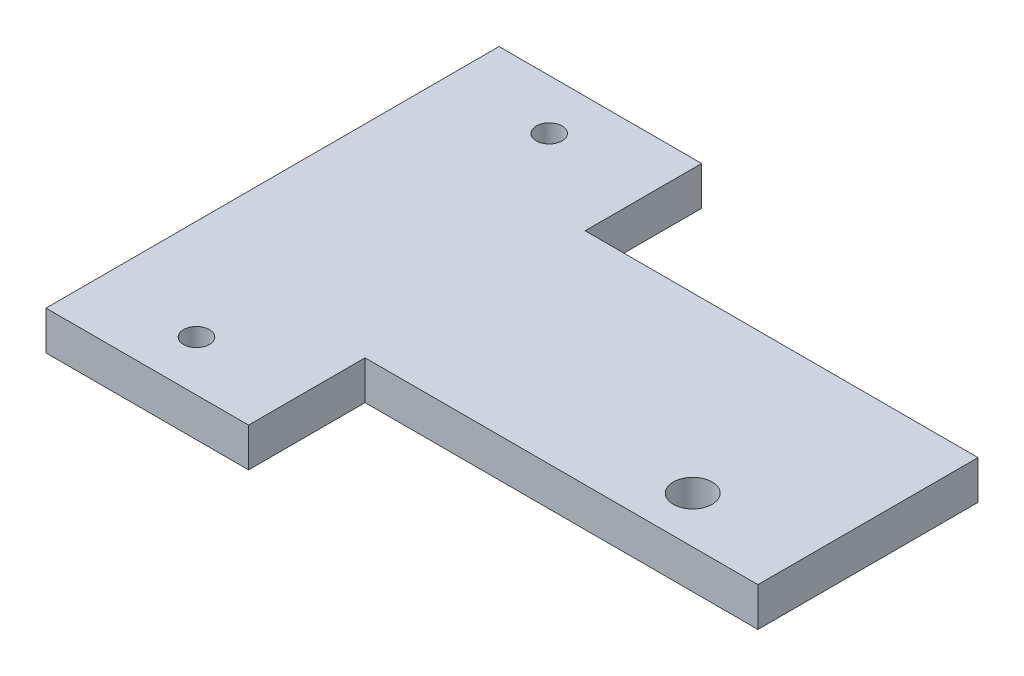
ISO-10303-21;
HEADER;
FILE_DESCRIPTION(('STEP AP214'),'2;1');
FILE_NAME('part.step','',(''),(''),'','','');
FILE_SCHEMA(('AUTOMOTIVE_DESIGN { 1 0 10303 214 1 1 1 1 }'));
ENDSEC;
DATA;
#1=APPLICATION_CONTEXT('core data for automotive mechanical design processes');
#2=APPLICATION_PROTOCOL_DEFINITION('international standard','automotive_design',2000,#1);
#3=PRODUCT_CONTEXT('',#1,'mechanical');
#4=PRODUCT('Part','Part','',(#3));
#5=PRODUCT_RELATED_PRODUCT_CATEGORY('part','',(#4));
#6=PRODUCT_DEFINITION_FORMATION('','',#4);
#7=PRODUCT_DEFINITION_CONTEXT('part definition',#1,'design');
#8=PRODUCT_DEFINITION('design','',#6,#7);
#9=PRODUCT_DEFINITION_SHAPE('','',#8);
#10=(LENGTH_UNIT() NAMED_UNIT(*) SI_UNIT(.MILLI.,.METRE.));
#11=(NAMED_UNIT(*) PLANE_ANGLE_UNIT() SI_UNIT($,.RADIAN.));
#12=(NAMED_UNIT(*) SI_UNIT($,.STERADIAN.) SOLID_ANGLE_UNIT());
#13=UNCERTAINTY_MEASURE_WITH_UNIT(LENGTH_MEASURE(1.E-05),#10,'distance_accuracy_value','');
#14=(GEOMETRIC_REPRESENTATION_CONTEXT(3) GLOBAL_UNCERTAINTY_ASSIGNED_CONTEXT((#13)) GLOBAL_UNIT_ASSIGNED_CONTEXT((#10,
#11,#12)) REPRESENTATION_CONTEXT('',''));
#15=CARTESIAN_POINT('',(0.,0.,0.));
#16=DIRECTION('',(0.,0.,1.));
#17=DIRECTION('',(1.,0.,0.));
#18=AXIS2_PLACEMENT_3D('',#15,#16,#17);
#19=CARTESIAN_POINT('',(23.,3.,-8.5));
#20=DIRECTION('',(0.,0.,1.));
#21=DIRECTION('',(1.,0.,0.));
#22=AXIS2_PLACEMENT_3D('',#19,#20,#21);
#23=PLANE('',#22);
#24=DIRECTION('',(0.,-1.,0.));
#25=VECTOR('',#24,1.);
#26=CARTESIAN_POINT('',(-7.35,0.,-8.5));
#27=LINE('',#26,#25);
#28=CARTESIAN_POINT('',(-7.35,3.,-8.5));
#29=VERTEX_POINT('',#28);
#30=CARTESIAN_POINT('',(-7.35,0.,-8.5));
#31=VERTEX_POINT('',#30);
#32=EDGE_CURVE('E65',#29,#31,#27,.T.);
#33=ORIENTED_EDGE('',*,*,#32,.F.);
#34=DIRECTION('',(-1.,0.,0.));
#35=VECTOR('',#34,1.);
#36=CARTESIAN_POINT('',(23.,3.,-8.5));
#37=LINE('',#36,#35);
#38=CARTESIAN_POINT('',(23.,3.,-8.5));
#39=VERTEX_POINT('',#38);
#40=EDGE_CURVE('E182',#39,#29,#37,.T.);
#41=ORIENTED_EDGE('',*,*,#40,.F.);
#42=DIRECTION('',(0.,-1.,0.));
#43=VECTOR('',#42,1.);
#44=CARTESIAN_POINT('',(23.,3.,-8.5));
#45=LINE('',#44,#43);
#46=CARTESIAN_POINT('',(23.,0.,-8.5));
#47=VERTEX_POINT('',#46);
#48=EDGE_CURVE('E49',#39,#47,#45,.T.);
#49=ORIENTED_EDGE('',*,*,#48,.T.);
#50=DIRECTION('',(-1.,0.,0.));
#51=VECTOR('',#50,1.);
#52=CARTESIAN_POINT('',(23.,0.,-8.5));
#53=LINE('',#52,#51);
#54=EDGE_CURVE('E176',#47,#31,#53,.T.);
#55=ORIENTED_EDGE('',*,*,#54,.T.);
#56=EDGE_LOOP('',(#33,#41,#49,#55));
#57=FACE_BOUND('',#56,.T.);
#58=ADVANCED_FACE('F39',(#57),#23,.F.);
#59=CARTESIAN_POINT('',(-23.,3.,8.5));
#60=DIRECTION('',(1.,0.,0.));
#61=DIRECTION('',(0.,0.,-1.));
#62=AXIS2_PLACEMENT_3D('',#59,#60,#61);
#63=PLANE('',#62);
#64=DIRECTION('',(0.,0.,1.));
#65=VECTOR('',#64,1.);
#66=CARTESIAN_POINT('',(-23.,0.,8.5));
#67=LINE('',#66,#65);
#68=CARTESIAN_POINT('',(-23.,0.,-17.5));
#69=VERTEX_POINT('',#68);
#70=CARTESIAN_POINT('',(-23.,0.,17.5));
#71=VERTEX_POINT('',#70);
#72=EDGE_CURVE('E109',#69,#71,#67,.T.);
#73=ORIENTED_EDGE('',*,*,#72,.T.);
#74=DIRECTION('',(0.,1.,0.));
#75=VECTOR('',#74,1.);
#76=CARTESIAN_POINT('',(-23.,0.,17.5));
#77=LINE('',#76,#75);
#78=CARTESIAN_POINT('',(-23.,3.,17.5));
#79=VERTEX_POINT('',#78);
#80=EDGE_CURVE('E111',#71,#79,#77,.T.);
#81=ORIENTED_EDGE('',*,*,#80,.T.);
#82=DIRECTION('',(0.,0.,1.));
#83=VECTOR('',#82,1.);
#84=CARTESIAN_POINT('',(-23.,3.,8.5));
#85=LINE('',#84,#83);
#86=CARTESIAN_POINT('',(-23.,3.,-17.5));
#87=VERTEX_POINT('',#86);
#88=EDGE_CURVE('E172',#87,#79,#85,.T.);
#89=ORIENTED_EDGE('',*,*,#88,.F.);
#90=DIRECTION('',(0.,1.,0.));
#91=VECTOR('',#90,1.);
#92=CARTESIAN_POINT('',(-23.,0.,-17.5));
#93=LINE('',#92,#91);
#94=EDGE_CURVE('E114',#69,#87,#93,.T.);
#95=ORIENTED_EDGE('',*,*,#94,.F.);
#96=EDGE_LOOP('',(#73,#81,#89,#95));
#97=FACE_BOUND('',#96,.T.);
#98=ADVANCED_FACE('F41',(#97),#63,.F.);
#99=CARTESIAN_POINT('',(23.,3.,8.5));
#100=DIRECTION('',(0.,0.,-1.));
#101=DIRECTION('',(-1.,0.,0.));
#102=AXIS2_PLACEMENT_3D('',#99,#100,#101);
#103=PLANE('',#102);
#104=DIRECTION('',(1.,0.,0.));
#105=VECTOR('',#104,1.);
#106=CARTESIAN_POINT('',(23.,3.,8.5));
#107=LINE('',#106,#105);
#108=CARTESIAN_POINT('',(-7.35,3.,8.5));
#109=VERTEX_POINT('',#108);
#110=CARTESIAN_POINT('',(23.,3.,8.5));
#111=VERTEX_POINT('',#110);
#112=EDGE_CURVE('E175',#109,#111,#107,.T.);
#113=ORIENTED_EDGE('',*,*,#112,.F.);
#114=DIRECTION('',(0.,-1.,0.));
#115=VECTOR('',#114,1.);
#116=CARTESIAN_POINT('',(-7.35,0.,8.5));
#117=LINE('',#116,#115);
#118=CARTESIAN_POINT('',(-7.35,0.,8.5));
#119=VERTEX_POINT('',#118);
#120=EDGE_CURVE('E131',#109,#119,#117,.T.);
#121=ORIENTED_EDGE('',*,*,#120,.T.);
#122=DIRECTION('',(1.,0.,0.));
#123=VECTOR('',#122,1.);
#124=CARTESIAN_POINT('',(23.,0.,8.5));
#125=LINE('',#124,#123);
#126=CARTESIAN_POINT('',(23.,0.,8.5));
#127=VERTEX_POINT('',#126);
#128=EDGE_CURVE('E120',#119,#127,#125,.T.);
#129=ORIENTED_EDGE('',*,*,#128,.T.);
#130=DIRECTION('',(0.,-1.,0.));
#131=VECTOR('',#130,1.);
#132=CARTESIAN_POINT('',(23.,3.,8.5));
#133=LINE('',#132,#131);
#134=EDGE_CURVE('E11',#111,#127,#133,.T.);
#135=ORIENTED_EDGE('',*,*,#134,.F.);
#136=EDGE_LOOP('',(#113,#121,#129,#135));
#137=FACE_BOUND('',#136,.T.);
#138=ADVANCED_FACE('F225',(#137),#103,.F.);
#139=CARTESIAN_POINT('',(23.,3.,8.5));
#140=DIRECTION('',(-1.,0.,0.));
#141=DIRECTION('',(0.,0.,1.));
#142=AXIS2_PLACEMENT_3D('',#139,#140,#141);
#143=PLANE('',#142);
#144=DIRECTION('',(0.,0.,-1.));
#145=VECTOR('',#144,1.);
#146=CARTESIAN_POINT('',(23.,0.,8.5));
#147=LINE('',#146,#145);
#148=EDGE_CURVE('E187',#127,#47,#147,.T.);
#149=ORIENTED_EDGE('',*,*,#148,.T.);
#150=ORIENTED_EDGE('',*,*,#48,.F.);
#151=DIRECTION('',(0.,0.,-1.));
#152=VECTOR('',#151,1.);
#153=CARTESIAN_POINT('',(23.,3.,8.5));
#154=LINE('',#153,#152);
#155=EDGE_CURVE('E179',#111,#39,#154,.T.);
#156=ORIENTED_EDGE('',*,*,#155,.F.);
#157=ORIENTED_EDGE('',*,*,#134,.T.);
#158=EDGE_LOOP('',(#149,#150,#156,#157));
#159=FACE_BOUND('',#158,.T.);
#160=ADVANCED_FACE('F229',(#159),#143,.F.);
#161=CARTESIAN_POINT('',(0.,3.,0.));
#162=DIRECTION('',(0.,1.,0.));
#163=DIRECTION('',(0.,0.,1.));
#164=AXIS2_PLACEMENT_3D('',#161,#162,#163);
#165=PLANE('',#164);
#166=CARTESIAN_POINT('',(14.36,3.,4.9));
#167=DIRECTION('',(0.,1.,0.));
#168=DIRECTION('',(0.,0.,1.));
#169=AXIS2_PLACEMENT_3D('',#166,#167,#168);
#170=CIRCLE('',#169,1.5);
#171=CARTESIAN_POINT('',(14.36,3.,6.4));
#172=VERTEX_POINT('',#171);
#173=EDGE_CURVE('E266',#172,#172,#170,.T.);
#174=ORIENTED_EDGE('',*,*,#173,.F.);
#175=EDGE_LOOP('',(#174));
#176=FACE_BOUND('',#175,.T.);
#177=CARTESIAN_POINT('',(-15.25,3.,-13.625));
#178=DIRECTION('',(0.,1.,0.));
#179=DIRECTION('',(0.,0.,1.));
#180=AXIS2_PLACEMENT_3D('',#177,#178,#179);
#181=CIRCLE('',#180,1.);
#182=CARTESIAN_POINT('',(-15.25,3.,-12.625));
#183=VERTEX_POINT('',#182);
#184=EDGE_CURVE('E198',#183,#183,#181,.T.);
#185=ORIENTED_EDGE('',*,*,#184,.F.);
#186=EDGE_LOOP('',(#185));
#187=FACE_BOUND('',#186,.T.);
#188=CARTESIAN_POINT('',(-15.25,3.,13.625));
#189=DIRECTION('',(0.,1.,0.));
#190=DIRECTION('',(0.,0.,1.));
#191=AXIS2_PLACEMENT_3D('',#188,#189,#190);
#192=CIRCLE('',#191,1.);
#193=CARTESIAN_POINT('',(-15.25,3.,14.625));
#194=VERTEX_POINT('',#193);
#195=EDGE_CURVE('E271',#194,#194,#192,.T.);
#196=ORIENTED_EDGE('',*,*,#195,.F.);
#197=EDGE_LOOP('',(#196));
#198=FACE_BOUND('',#197,.T.);
#199=ORIENTED_EDGE('',*,*,#88,.T.);
#200=DIRECTION('',(1.,0.,0.));
#201=VECTOR('',#200,1.);
#202=CARTESIAN_POINT('',(-23.,3.,17.5));
#203=LINE('',#202,#201);
#204=CARTESIAN_POINT('',(-7.35,3.,17.5));
#205=VERTEX_POINT('',#204);
#206=EDGE_CURVE('E129',#79,#205,#203,.T.);
#207=ORIENTED_EDGE('',*,*,#206,.T.);
#208=DIRECTION('',(0.,0.,-1.));
#209=VECTOR('',#208,1.);
#210=CARTESIAN_POINT('',(-7.35,3.,17.5));
#211=LINE('',#210,#209);
#212=EDGE_CURVE('E144',#205,#109,#211,.T.);
#213=ORIENTED_EDGE('',*,*,#212,.T.);
#214=ORIENTED_EDGE('',*,*,#112,.T.);
#215=ORIENTED_EDGE('',*,*,#155,.T.);
#216=ORIENTED_EDGE('',*,*,#40,.T.);
#217=DIRECTION('',(0.,0.,1.));
#218=VECTOR('',#217,1.);
#219=CARTESIAN_POINT('',(-7.35,3.,-17.5));
#220=LINE('',#219,#218);
#221=CARTESIAN_POINT('',(-7.35,3.,-17.5));
#222=VERTEX_POINT('',#221);
#223=EDGE_CURVE('E121',#222,#29,#220,.T.);
#224=ORIENTED_EDGE('',*,*,#223,.F.);
#225=DIRECTION('',(1.,0.,0.));
#226=VECTOR('',#225,1.);
#227=CARTESIAN_POINT('',(-23.,3.,-17.5));
#228=LINE('',#227,#226);
#229=EDGE_CURVE('E154',#87,#222,#228,.T.);
#230=ORIENTED_EDGE('',*,*,#229,.F.);
#231=EDGE_LOOP('',(#199,#207,#213,#214,#215,#216,#224,#230));
#232=FACE_BOUND('',#231,.T.);
#233=ADVANCED_FACE('F231',(#176,#187,#198,#232),#165,.T.);
#234=CARTESIAN_POINT('',(0.,0.,0.));
#235=DIRECTION('',(0.,1.,0.));
#236=DIRECTION('',(0.,0.,1.));
#237=AXIS2_PLACEMENT_3D('',#234,#235,#236);
#238=PLANE('',#237);
#239=CARTESIAN_POINT('',(14.36,0.,4.9));
#240=DIRECTION('',(0.,1.,0.));
#241=DIRECTION('',(0.,0.,1.));
#242=AXIS2_PLACEMENT_3D('',#239,#240,#241);
#243=CIRCLE('',#242,1.5);
#244=CARTESIAN_POINT('',(14.36,0.,6.4));
#245=VERTEX_POINT('',#244);
#246=EDGE_CURVE('E43',#245,#245,#243,.T.);
#247=ORIENTED_EDGE('',*,*,#246,.T.);
#248=EDGE_LOOP('',(#247));
#249=FACE_BOUND('',#248,.T.);
#250=CARTESIAN_POINT('',(-15.25,0.,-13.625));
#251=DIRECTION('',(0.,1.,0.));
#252=DIRECTION('',(0.,0.,1.));
#253=AXIS2_PLACEMENT_3D('',#250,#251,#252);
#254=CIRCLE('',#253,1.);
#255=CARTESIAN_POINT('',(-15.25,0.,-12.625));
#256=VERTEX_POINT('',#255);
#257=EDGE_CURVE('E147',#256,#256,#254,.T.);
#258=ORIENTED_EDGE('',*,*,#257,.T.);
#259=EDGE_LOOP('',(#258));
#260=FACE_BOUND('',#259,.T.);
#261=CARTESIAN_POINT('',(-15.25,0.,13.625));
#262=DIRECTION('',(0.,1.,0.));
#263=DIRECTION('',(0.,0.,1.));
#264=AXIS2_PLACEMENT_3D('',#261,#262,#263);
#265=CIRCLE('',#264,1.);
#266=CARTESIAN_POINT('',(-15.25,0.,14.625));
#267=VERTEX_POINT('',#266);
#268=EDGE_CURVE('E195',#267,#267,#265,.T.);
#269=ORIENTED_EDGE('',*,*,#268,.T.);
#270=EDGE_LOOP('',(#269));
#271=FACE_BOUND('',#270,.T.);
#272=ORIENTED_EDGE('',*,*,#72,.F.);
#273=DIRECTION('',(-1.,0.,0.));
#274=VECTOR('',#273,1.);
#275=CARTESIAN_POINT('',(-23.,0.,-17.5));
#276=LINE('',#275,#274);
#277=CARTESIAN_POINT('',(-7.35,0.,-17.5));
#278=VERTEX_POINT('',#277);
#279=EDGE_CURVE('E160',#278,#69,#276,.T.);
#280=ORIENTED_EDGE('',*,*,#279,.F.);
#281=DIRECTION('',(0.,0.,1.));
#282=VECTOR('',#281,1.);
#283=CARTESIAN_POINT('',(-7.35,0.,-17.5));
#284=LINE('',#283,#282);
#285=EDGE_CURVE('E163',#278,#31,#284,.T.);
#286=ORIENTED_EDGE('',*,*,#285,.T.);
#287=ORIENTED_EDGE('',*,*,#54,.F.);
#288=ORIENTED_EDGE('',*,*,#148,.F.);
#289=ORIENTED_EDGE('',*,*,#128,.F.);
#290=DIRECTION('',(0.,0.,-1.));
#291=VECTOR('',#290,1.);
#292=CARTESIAN_POINT('',(-7.35,0.,17.5));
#293=LINE('',#292,#291);
#294=CARTESIAN_POINT('',(-7.35,0.,17.5));
#295=VERTEX_POINT('',#294);
#296=EDGE_CURVE('E57',#295,#119,#293,.T.);
#297=ORIENTED_EDGE('',*,*,#296,.F.);
#298=DIRECTION('',(-1.,0.,0.));
#299=VECTOR('',#298,1.);
#300=CARTESIAN_POINT('',(-23.,0.,17.5));
#301=LINE('',#300,#299);
#302=EDGE_CURVE('E127',#295,#71,#301,.T.);
#303=ORIENTED_EDGE('',*,*,#302,.T.);
#304=EDGE_LOOP('',(#272,#280,#286,#287,#288,#289,#297,#303));
#305=FACE_BOUND('',#304,.T.);
#306=ADVANCED_FACE('F133',(#249,#260,#271,#305),#238,.F.);
#307=CARTESIAN_POINT('',(-7.35,0.,-17.5));
#308=DIRECTION('',(-1.,0.,0.));
#309=DIRECTION('',(0.,0.,1.));
#310=AXIS2_PLACEMENT_3D('',#307,#308,#309);
#311=PLANE('',#310);
#312=ORIENTED_EDGE('',*,*,#32,.T.);
#313=ORIENTED_EDGE('',*,*,#285,.F.);
#314=DIRECTION('',(0.,-1.,0.));
#315=VECTOR('',#314,1.);
#316=CARTESIAN_POINT('',(-7.35,0.,-17.5));
#317=LINE('',#316,#315);
#318=EDGE_CURVE('E157',#222,#278,#317,.T.);
#319=ORIENTED_EDGE('',*,*,#318,.F.);
#320=ORIENTED_EDGE('',*,*,#223,.T.);
#321=EDGE_LOOP('',(#312,#313,#319,#320));
#322=FACE_BOUND('',#321,.T.);
#323=ADVANCED_FACE('F251',(#322),#311,.F.);
#324=CARTESIAN_POINT('',(0.,0.,-17.5));
#325=DIRECTION('',(0.,0.,-1.));
#326=DIRECTION('',(-1.,0.,0.));
#327=AXIS2_PLACEMENT_3D('',#324,#325,#326);
#328=PLANE('',#327);
#329=ORIENTED_EDGE('',*,*,#94,.T.);
#330=ORIENTED_EDGE('',*,*,#229,.T.);
#331=ORIENTED_EDGE('',*,*,#318,.T.);
#332=ORIENTED_EDGE('',*,*,#279,.T.);
#333=EDGE_LOOP('',(#329,#330,#331,#332));
#334=FACE_BOUND('',#333,.T.);
#335=ADVANCED_FACE('F244',(#334),#328,.T.);
#336=CARTESIAN_POINT('',(-7.35,0.,17.5));
#337=DIRECTION('',(1.,0.,0.));
#338=DIRECTION('',(0.,0.,-1.));
#339=AXIS2_PLACEMENT_3D('',#336,#337,#338);
#340=PLANE('',#339);
#341=ORIENTED_EDGE('',*,*,#120,.F.);
#342=ORIENTED_EDGE('',*,*,#212,.F.);
#343=DIRECTION('',(0.,-1.,0.));
#344=VECTOR('',#343,1.);
#345=CARTESIAN_POINT('',(-7.35,0.,17.5));
#346=LINE('',#345,#344);
#347=EDGE_CURVE('E136',#205,#295,#346,.T.);
#348=ORIENTED_EDGE('',*,*,#347,.T.);
#349=ORIENTED_EDGE('',*,*,#296,.T.);
#350=EDGE_LOOP('',(#341,#342,#348,#349));
#351=FACE_BOUND('',#350,.T.);
#352=ADVANCED_FACE('F242',(#351),#340,.T.);
#353=CARTESIAN_POINT('',(0.,0.,17.5));
#354=DIRECTION('',(0.,0.,1.));
#355=DIRECTION('',(-1.,0.,0.));
#356=AXIS2_PLACEMENT_3D('',#353,#354,#355);
#357=PLANE('',#356);
#358=ORIENTED_EDGE('',*,*,#80,.F.);
#359=ORIENTED_EDGE('',*,*,#302,.F.);
#360=ORIENTED_EDGE('',*,*,#347,.F.);
#361=ORIENTED_EDGE('',*,*,#206,.F.);
#362=EDGE_LOOP('',(#358,#359,#360,#361));
#363=FACE_BOUND('',#362,.T.);
#364=ADVANCED_FACE('F125',(#363),#357,.T.);
#365=CARTESIAN_POINT('',(-15.25,-7.,13.625));
#366=DIRECTION('',(0.,1.,0.));
#367=DIRECTION('',(0.,0.,1.));
#368=AXIS2_PLACEMENT_3D('',#365,#366,#367);
#369=CYLINDRICAL_SURFACE('',#368,1.);
#370=ORIENTED_EDGE('',*,*,#195,.T.);
#371=EDGE_LOOP('',(#370));
#372=FACE_BOUND('',#371,.T.);
#373=ORIENTED_EDGE('',*,*,#268,.F.);
#374=EDGE_LOOP('',(#373));
#375=FACE_BOUND('',#374,.T.);
#376=ADVANCED_FACE('F208',(#372,#375),#369,.F.);
#377=CARTESIAN_POINT('',(-15.25,-7.,-13.625));
#378=DIRECTION('',(0.,1.,0.));
#379=DIRECTION('',(0.,0.,1.));
#380=AXIS2_PLACEMENT_3D('',#377,#378,#379);
#381=CYLINDRICAL_SURFACE('',#380,1.);
#382=ORIENTED_EDGE('',*,*,#184,.T.);
#383=EDGE_LOOP('',(#382));
#384=FACE_BOUND('',#383,.T.);
#385=ORIENTED_EDGE('',*,*,#257,.F.);
#386=EDGE_LOOP('',(#385));
#387=FACE_BOUND('',#386,.T.);
#388=ADVANCED_FACE('F205',(#384,#387),#381,.F.);
#389=CARTESIAN_POINT('',(14.36,-7.,4.9));
#390=DIRECTION('',(0.,1.,0.));
#391=DIRECTION('',(0.,0.,1.));
#392=AXIS2_PLACEMENT_3D('',#389,#390,#391);
#393=CYLINDRICAL_SURFACE('',#392,1.5);
#394=ORIENTED_EDGE('',*,*,#173,.T.);
#395=EDGE_LOOP('',(#394));
#396=FACE_BOUND('',#395,.T.);
#397=ORIENTED_EDGE('',*,*,#246,.F.);
#398=EDGE_LOOP('',(#397));
#399=FACE_BOUND('',#398,.T.);
#400=ADVANCED_FACE('F207',(#396,#399),#393,.F.);
#401=CLOSED_SHELL('',(#58,#98,#138,#160,#233,#306,#323,#335,#352,#364,#376,#388,#400));
#402=MANIFOLD_SOLID_BREP('B2',#401);
#403=ADVANCED_BREP_SHAPE_REPRESENTATION('',(#18,#402),#14);
#404=SHAPE_DEFINITION_REPRESENTATION(#9,#403);
ENDSEC;
END-ISO-10303-21;
